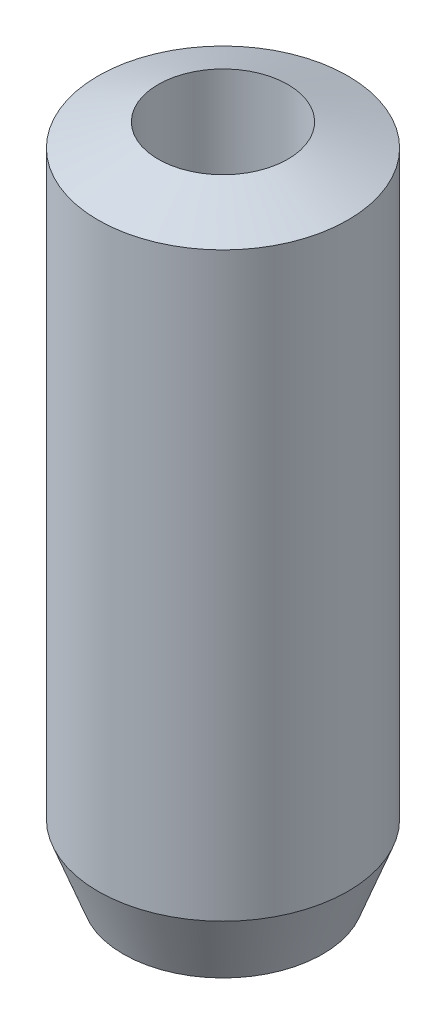
ISO-10303-21;
HEADER;
FILE_DESCRIPTION(('STEP AP214'),'2;1');
FILE_NAME('part.step','',(''),(''),'','','');
FILE_SCHEMA(('AUTOMOTIVE_DESIGN { 1 0 10303 214 1 1 1 1 }'));
ENDSEC;
DATA;
#1=APPLICATION_CONTEXT('core data for automotive mechanical design processes');
#2=APPLICATION_PROTOCOL_DEFINITION('international standard','automotive_design',2000,#1);
#3=PRODUCT_CONTEXT('',#1,'mechanical');
#4=PRODUCT('Part','Part','',(#3));
#5=PRODUCT_RELATED_PRODUCT_CATEGORY('part','',(#4));
#6=PRODUCT_DEFINITION_FORMATION('','',#4);
#7=PRODUCT_DEFINITION_CONTEXT('part definition',#1,'design');
#8=PRODUCT_DEFINITION('design','',#6,#7);
#9=PRODUCT_DEFINITION_SHAPE('','',#8);
#10=(LENGTH_UNIT() NAMED_UNIT(*) SI_UNIT(.MILLI.,.METRE.));
#11=(NAMED_UNIT(*) PLANE_ANGLE_UNIT() SI_UNIT($,.RADIAN.));
#12=(NAMED_UNIT(*) SI_UNIT($,.STERADIAN.) SOLID_ANGLE_UNIT());
#13=UNCERTAINTY_MEASURE_WITH_UNIT(LENGTH_MEASURE(1.E-05),#10,'distance_accuracy_value','');
#14=(GEOMETRIC_REPRESENTATION_CONTEXT(3) GLOBAL_UNCERTAINTY_ASSIGNED_CONTEXT((#13)) GLOBAL_UNIT_ASSIGNED_CONTEXT((#10,
#11,#12)) REPRESENTATION_CONTEXT('',''));
#15=CARTESIAN_POINT('',(0.,0.,0.));
#16=DIRECTION('',(0.,0.,1.));
#17=DIRECTION('',(1.,0.,0.));
#18=AXIS2_PLACEMENT_3D('',#15,#16,#17);
#19=CARTESIAN_POINT('',(0.,80.9015738392144,0.));
#20=DIRECTION('',(0.,-1.,0.));
#21=DIRECTION('',(0.,0.,-1.));
#22=AXIS2_PLACEMENT_3D('',#19,#20,#21);
#23=CYLINDRICAL_SURFACE('',#22,15.);
#24=CARTESIAN_POINT('',(0.,77.8715698617337,0.));
#25=DIRECTION('',(0.,1.,0.));
#26=DIRECTION('',(0.,0.,1.));
#27=AXIS2_PLACEMENT_3D('',#24,#25,#26);
#28=CIRCLE('',#27,15.);
#29=CARTESIAN_POINT('',(0.,77.8715698617337,15.));
#30=VERTEX_POINT('',#29);
#31=EDGE_CURVE('E50',#30,#30,#28,.F.);
#32=ORIENTED_EDGE('',*,*,#31,.T.);
#33=EDGE_LOOP('',(#32));
#34=FACE_BOUND('',#33,.T.);
#35=CARTESIAN_POINT('',(0.,8.04455611953055,0.));
#36=DIRECTION('',(0.,1.,0.));
#37=DIRECTION('',(0.,0.,1.));
#38=AXIS2_PLACEMENT_3D('',#35,#36,#37);
#39=CIRCLE('',#38,15.);
#40=CARTESIAN_POINT('',(0.,8.04455611953055,15.));
#41=VERTEX_POINT('',#40);
#42=EDGE_CURVE('E51',#41,#41,#39,.T.);
#43=ORIENTED_EDGE('',*,*,#42,.T.);
#44=EDGE_LOOP('',(#43));
#45=FACE_BOUND('',#44,.T.);
#46=ADVANCED_FACE('F39',(#34,#45),#23,.T.);
#47=CARTESIAN_POINT('',(0.,0.,0.));
#48=DIRECTION('',(0.,1.,0.));
#49=DIRECTION('',(0.,0.,1.));
#50=AXIS2_PLACEMENT_3D('',#47,#48,#49);
#51=PLANE('',#50);
#52=CARTESIAN_POINT('',(0.,0.,0.));
#53=DIRECTION('',(0.,1.,0.));
#54=DIRECTION('',(0.,0.,1.));
#55=AXIS2_PLACEMENT_3D('',#52,#53,#54);
#56=CIRCLE('',#55,11.9699960225194);
#57=CARTESIAN_POINT('',(0.,0.,11.9699960225194));
#58=VERTEX_POINT('',#57);
#59=EDGE_CURVE('E10',#58,#58,#56,.F.);
#60=ORIENTED_EDGE('',*,*,#59,.T.);
#61=EDGE_LOOP('',(#60));
#62=FACE_BOUND('',#61,.T.);
#63=CARTESIAN_POINT('',(0.,0.,0.));
#64=DIRECTION('',(0.,1.,0.));
#65=DIRECTION('',(0.,0.,1.));
#66=AXIS2_PLACEMENT_3D('',#63,#64,#65);
#67=CIRCLE('',#66,7.78381544064881);
#68=CARTESIAN_POINT('',(0.,0.,7.78381544064881));
#69=VERTEX_POINT('',#68);
#70=EDGE_CURVE('E58',#69,#69,#67,.T.);
#71=ORIENTED_EDGE('',*,*,#70,.T.);
#72=EDGE_LOOP('',(#71));
#73=FACE_BOUND('',#72,.T.);
#74=ADVANCED_FACE('F62',(#62,#73),#51,.F.);
#75=CARTESIAN_POINT('',(0.,80.9015738392144,0.));
#76=DIRECTION('',(0.,-1.,0.));
#77=DIRECTION('',(0.,0.,-1.));
#78=AXIS2_PLACEMENT_3D('',#75,#76,#77);
#79=CYLINDRICAL_SURFACE('',#78,7.78381544064881);
#80=CARTESIAN_POINT('',(0.,80.5895654344147,0.));
#81=DIRECTION('',(0.,-1.,0.));
#82=DIRECTION('',(0.,0.,-1.));
#83=AXIS2_PLACEMENT_3D('',#80,#81,#82);
#84=CIRCLE('',#83,7.78381544064881);
#85=CARTESIAN_POINT('',(0.,80.5895654344147,-7.78381544064881));
#86=VERTEX_POINT('',#85);
#87=EDGE_CURVE('E54',#86,#86,#84,.F.);
#88=ORIENTED_EDGE('',*,*,#87,.T.);
#89=EDGE_LOOP('',(#88));
#90=FACE_BOUND('',#89,.T.);
#91=ORIENTED_EDGE('',*,*,#70,.F.);
#92=EDGE_LOOP('',(#91));
#93=FACE_BOUND('',#92,.T.);
#94=ADVANCED_FACE('F68',(#90,#93),#79,.F.);
#95=CARTESIAN_POINT('',(0.,80.9015738392144,0.));
#96=DIRECTION('',(0.,-1.,0.));
#97=DIRECTION('',(0.,0.,-1.));
#98=AXIS2_PLACEMENT_3D('',#95,#96,#97);
#99=CONICAL_SURFACE('',#98,6.95544388046919,1.21057748072919);
#100=ORIENTED_EDGE('',*,*,#31,.F.);
#101=EDGE_LOOP('',(#100));
#102=FACE_BOUND('',#101,.T.);
#103=ORIENTED_EDGE('',*,*,#87,.F.);
#104=EDGE_LOOP('',(#103));
#105=FACE_BOUND('',#104,.T.);
#106=ADVANCED_FACE('F66',(#102,#105),#99,.T.);
#107=CARTESIAN_POINT('',(0.,8.04455611953055,0.));
#108=DIRECTION('',(0.,1.,0.));
#109=DIRECTION('',(0.,0.,1.));
#110=AXIS2_PLACEMENT_3D('',#107,#108,#109);
#111=CONICAL_SURFACE('',#110,15.,0.360218846065712);
#112=ORIENTED_EDGE('',*,*,#59,.F.);
#113=EDGE_LOOP('',(#112));
#114=FACE_BOUND('',#113,.T.);
#115=ORIENTED_EDGE('',*,*,#42,.F.);
#116=EDGE_LOOP('',(#115));
#117=FACE_BOUND('',#116,.T.);
#118=ADVANCED_FACE('F45',(#114,#117),#111,.T.);
#119=CLOSED_SHELL('',(#46,#74,#94,#106,#118));
#120=MANIFOLD_SOLID_BREP('B2',#119);
#121=ADVANCED_BREP_SHAPE_REPRESENTATION('',(#18,#120),#14);
#122=SHAPE_DEFINITION_REPRESENTATION(#9,#121);
ENDSEC;
END-ISO-10303-21;
